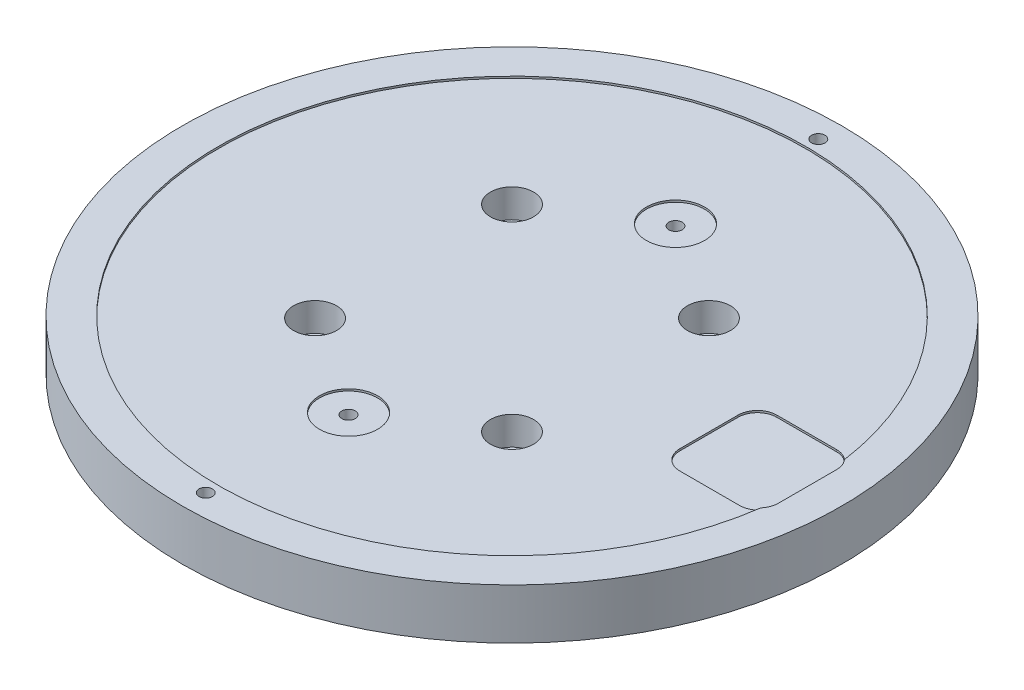
ISO-10303-21;
HEADER;
FILE_DESCRIPTION(('STEP AP214'),'2;1');
FILE_NAME('part.step','',(''),(''),'','','');
FILE_SCHEMA(('AUTOMOTIVE_DESIGN { 1 0 10303 214 1 1 1 1 }'));
ENDSEC;
DATA;
#1=APPLICATION_CONTEXT('core data for automotive mechanical design processes');
#2=APPLICATION_PROTOCOL_DEFINITION('international standard','automotive_design',2000,#1);
#3=PRODUCT_CONTEXT('',#1,'mechanical');
#4=PRODUCT('Part','Part','',(#3));
#5=PRODUCT_RELATED_PRODUCT_CATEGORY('part','',(#4));
#6=PRODUCT_DEFINITION_FORMATION('','',#4);
#7=PRODUCT_DEFINITION_CONTEXT('part definition',#1,'design');
#8=PRODUCT_DEFINITION('design','',#6,#7);
#9=PRODUCT_DEFINITION_SHAPE('','',#8);
#10=(LENGTH_UNIT() NAMED_UNIT(*) SI_UNIT(.MILLI.,.METRE.));
#11=(NAMED_UNIT(*) PLANE_ANGLE_UNIT() SI_UNIT($,.RADIAN.));
#12=(NAMED_UNIT(*) SI_UNIT($,.STERADIAN.) SOLID_ANGLE_UNIT());
#13=UNCERTAINTY_MEASURE_WITH_UNIT(LENGTH_MEASURE(1.E-05),#10,'distance_accuracy_value','');
#14=(GEOMETRIC_REPRESENTATION_CONTEXT(3) GLOBAL_UNCERTAINTY_ASSIGNED_CONTEXT((#13)) GLOBAL_UNIT_ASSIGNED_CONTEXT((#10,
#11,#12)) REPRESENTATION_CONTEXT('',''));
#15=CARTESIAN_POINT('',(0.,0.,0.));
#16=DIRECTION('',(0.,0.,1.));
#17=DIRECTION('',(1.,0.,0.));
#18=AXIS2_PLACEMENT_3D('',#15,#16,#17);
#19=CARTESIAN_POINT('',(0.,-13.,0.));
#20=DIRECTION('',(0.,1.,0.));
#21=DIRECTION('',(0.,0.,1.));
#22=AXIS2_PLACEMENT_3D('',#19,#20,#21);
#23=CYLINDRICAL_SURFACE('',#22,85.);
#24=CARTESIAN_POINT('',(0.,-13.,0.));
#25=DIRECTION('',(0.,1.,0.));
#26=DIRECTION('',(0.,0.,1.));
#27=AXIS2_PLACEMENT_3D('',#24,#25,#26);
#28=CIRCLE('',#27,85.);
#29=CARTESIAN_POINT('',(0.,-13.,85.));
#30=VERTEX_POINT('',#29);
#31=EDGE_CURVE('E394',#30,#30,#28,.T.);
#32=CARTESIAN_POINT('',(0.,0.,0.));
#33=DIRECTION('',(0.,1.,0.));
#34=DIRECTION('',(0.,0.,1.));
#35=AXIS2_PLACEMENT_3D('',#32,#33,#34);
#36=CIRCLE('',#35,85.);
#37=CARTESIAN_POINT('',(0.,0.,85.));
#38=VERTEX_POINT('',#37);
#39=EDGE_CURVE('E398',#38,#38,#36,.T.);
#40=CARTESIAN_POINT('',(0.,-13.,85.));
#41=CARTESIAN_POINT('',(0.,-12.8645833333333,85.));
#42=CARTESIAN_POINT('',(0.,-12.7291666666667,85.));
#43=CARTESIAN_POINT('',(0.,-12.4583333333333,85.));
#44=CARTESIAN_POINT('',(0.,-12.3229166666667,85.));
#45=CARTESIAN_POINT('',(0.,-12.0520833333333,85.));
#46=CARTESIAN_POINT('',(0.,-11.9166666666667,85.));
#47=CARTESIAN_POINT('',(0.,-11.6458333333333,85.));
#48=CARTESIAN_POINT('',(0.,-11.5104166666667,85.));
#49=CARTESIAN_POINT('',(0.,-11.2395833333333,85.));
#50=CARTESIAN_POINT('',(0.,-11.1041666666667,85.));
#51=CARTESIAN_POINT('',(0.,-10.8333333333333,85.));
#52=CARTESIAN_POINT('',(0.,-10.6979166666667,85.));
#53=CARTESIAN_POINT('',(0.,-10.4270833333333,85.));
#54=CARTESIAN_POINT('',(0.,-10.2916666666667,85.));
#55=CARTESIAN_POINT('',(0.,-10.0208333333333,85.));
#56=CARTESIAN_POINT('',(0.,-9.88541666666667,85.));
#57=CARTESIAN_POINT('',(0.,-9.61458333333333,85.));
#58=CARTESIAN_POINT('',(0.,-9.47916666666667,85.));
#59=CARTESIAN_POINT('',(0.,-9.20833333333333,85.));
#60=CARTESIAN_POINT('',(0.,-9.07291666666667,85.));
#61=CARTESIAN_POINT('',(0.,-8.80208333333333,85.));
#62=CARTESIAN_POINT('',(0.,-8.66666666666667,85.));
#63=CARTESIAN_POINT('',(0.,-8.39583333333333,85.));
#64=CARTESIAN_POINT('',(0.,-8.26041666666667,85.));
#65=CARTESIAN_POINT('',(0.,-7.98958333333333,85.));
#66=CARTESIAN_POINT('',(0.,-7.85416666666667,85.));
#67=CARTESIAN_POINT('',(0.,-7.58333333333333,85.));
#68=CARTESIAN_POINT('',(0.,-7.44791666666667,85.));
#69=CARTESIAN_POINT('',(0.,-7.17708333333333,85.));
#70=CARTESIAN_POINT('',(0.,-7.04166666666667,85.));
#71=CARTESIAN_POINT('',(0.,-6.77083333333333,85.));
#72=CARTESIAN_POINT('',(0.,-6.63541666666667,85.));
#73=CARTESIAN_POINT('',(0.,-6.36458333333333,85.));
#74=CARTESIAN_POINT('',(0.,-6.22916666666667,85.));
#75=CARTESIAN_POINT('',(0.,-5.95833333333333,85.));
#76=CARTESIAN_POINT('',(0.,-5.82291666666667,85.));
#77=CARTESIAN_POINT('',(0.,-5.55208333333333,85.));
#78=CARTESIAN_POINT('',(0.,-5.41666666666667,85.));
#79=CARTESIAN_POINT('',(0.,-5.14583333333333,85.));
#80=CARTESIAN_POINT('',(0.,-5.01041666666667,85.));
#81=CARTESIAN_POINT('',(0.,-4.73958333333333,85.));
#82=CARTESIAN_POINT('',(0.,-4.60416666666667,85.));
#83=CARTESIAN_POINT('',(0.,-4.33333333333333,85.));
#84=CARTESIAN_POINT('',(0.,-4.19791666666667,85.));
#85=CARTESIAN_POINT('',(0.,-3.92708333333333,85.));
#86=CARTESIAN_POINT('',(0.,-3.79166666666667,85.));
#87=CARTESIAN_POINT('',(0.,-3.52083333333333,85.));
#88=CARTESIAN_POINT('',(0.,-3.38541666666667,85.));
#89=CARTESIAN_POINT('',(0.,-3.11458333333333,85.));
#90=CARTESIAN_POINT('',(0.,-2.97916666666667,85.));
#91=CARTESIAN_POINT('',(0.,-2.70833333333333,85.));
#92=CARTESIAN_POINT('',(0.,-2.57291666666667,85.));
#93=CARTESIAN_POINT('',(0.,-2.30208333333333,85.));
#94=CARTESIAN_POINT('',(0.,-2.16666666666667,85.));
#95=CARTESIAN_POINT('',(0.,-1.89583333333333,85.));
#96=CARTESIAN_POINT('',(0.,-1.76041666666667,85.));
#97=CARTESIAN_POINT('',(0.,-1.48958333333333,85.));
#98=CARTESIAN_POINT('',(0.,-1.35416666666667,85.));
#99=CARTESIAN_POINT('',(0.,-1.08333333333333,85.));
#100=CARTESIAN_POINT('',(0.,-0.947916666666667,85.));
#101=CARTESIAN_POINT('',(0.,-0.677083333333334,85.));
#102=CARTESIAN_POINT('',(0.,-0.541666666666667,85.));
#103=CARTESIAN_POINT('',(0.,-0.270833333333334,85.));
#104=CARTESIAN_POINT('',(0.,-0.135416666666667,85.));
#105=CARTESIAN_POINT('',(0.,0.,85.));
#106=B_SPLINE_CURVE_WITH_KNOTS('',3,(#40,#41,#42,#43,#44,#45,#46,#47,#48,#49,#50,#51,#52,#53,
#54,#55,#56,#57,#58,#59,#60,#61,#62,#63,#64,#65,#66,#67,#68,#69,#70,#71,#72,#73,#74,#75,#76,#77,
#78,#79,#80,#81,#82,#83,#84,#85,#86,#87,#88,#89,#90,#91,#92,#93,#94,#95,#96,#97,#98,#99,#100,
#101,#102,#103,#104,#105),.UNSPECIFIED.,.F.,.F.,(4,2,2,2,2,2,2,2,2,2,2,2,2,2,2,2,2,2,2,2,2,2,2,
2,2,2,2,2,2,2,2,2,4),(0.,0.40625,0.812500000000001,1.21875,1.625,2.03125,2.4375,2.84375,3.25,
3.65625,4.0625,4.46875,4.875,5.28125,5.6875,6.09375,6.5,6.90625,7.3125,7.71875,8.125,8.53125,
8.9375,9.34375,9.75,10.15625,10.5625,10.96875,11.375,11.78125,12.1875,12.59375,13.),.UNSPECIFIED.);
#107=EDGE_CURVE('BSEAM41',#30,#38,#106,.T.);
#108=ORIENTED_EDGE('',*,*,#31,.T.);
#109=ORIENTED_EDGE('',*,*,#39,.F.);
#110=ORIENTED_EDGE('',*,*,#107,.T.);
#111=ORIENTED_EDGE('',*,*,#107,.F.);
#112=EDGE_LOOP('',(#108,#110,#109,#111));
#113=FACE_BOUND('',#112,.T.);
#114=ADVANCED_FACE('F41',(#113),#23,.T.);
#115=CARTESIAN_POINT('',(0.,-13.,0.));
#116=DIRECTION('',(0.,1.,0.));
#117=DIRECTION('',(0.,0.,1.));
#118=AXIS2_PLACEMENT_3D('',#115,#116,#117);
#119=PLANE('',#118);
#120=CARTESIAN_POINT('',(-25.4,-13.,25.4));
#121=DIRECTION('',(0.,1.,0.));
#122=DIRECTION('',(0.,0.,1.));
#123=AXIS2_PLACEMENT_3D('',#120,#121,#122);
#124=CIRCLE('',#123,3.3782);
#125=CARTESIAN_POINT('',(-25.4,-13.,28.7782));
#126=VERTEX_POINT('',#125);
#127=EDGE_CURVE('E420',#126,#126,#124,.T.);
#128=ORIENTED_EDGE('',*,*,#127,.T.);
#129=EDGE_LOOP('',(#128));
#130=FACE_BOUND('',#129,.T.);
#131=CARTESIAN_POINT('',(25.4,-13.,25.4));
#132=DIRECTION('',(0.,1.,0.));
#133=DIRECTION('',(0.,0.,1.));
#134=AXIS2_PLACEMENT_3D('',#131,#132,#133);
#135=CIRCLE('',#134,3.3782);
#136=CARTESIAN_POINT('',(25.4,-13.,28.7782));
#137=VERTEX_POINT('',#136);
#138=EDGE_CURVE('E426',#137,#137,#135,.T.);
#139=ORIENTED_EDGE('',*,*,#138,.T.);
#140=EDGE_LOOP('',(#139));
#141=FACE_BOUND('',#140,.T.);
#142=CARTESIAN_POINT('',(25.4,-13.,-25.4));
#143=DIRECTION('',(0.,1.,0.));
#144=DIRECTION('',(0.,0.,1.));
#145=AXIS2_PLACEMENT_3D('',#142,#143,#144);
#146=CIRCLE('',#145,3.3782);
#147=CARTESIAN_POINT('',(25.4,-13.,-22.0218));
#148=VERTEX_POINT('',#147);
#149=EDGE_CURVE('E433',#148,#148,#146,.T.);
#150=ORIENTED_EDGE('',*,*,#149,.T.);
#151=EDGE_LOOP('',(#150));
#152=FACE_BOUND('',#151,.T.);
#153=CARTESIAN_POINT('',(-25.4,-13.,-25.4));
#154=DIRECTION('',(0.,1.,0.));
#155=DIRECTION('',(0.,0.,1.));
#156=AXIS2_PLACEMENT_3D('',#153,#154,#155);
#157=CIRCLE('',#156,3.3782);
#158=CARTESIAN_POINT('',(-25.4,-13.,-22.0218));
#159=VERTEX_POINT('',#158);
#160=EDGE_CURVE('E439',#159,#159,#157,.T.);
#161=ORIENTED_EDGE('',*,*,#160,.T.);
#162=EDGE_LOOP('',(#161));
#163=FACE_BOUND('',#162,.T.);
#164=ORIENTED_EDGE('',*,*,#31,.F.);
#165=EDGE_LOOP('',(#164));
#166=FACE_BOUND('',#165,.T.);
#167=ADVANCED_FACE('F965',(#130,#141,#152,#163,#166),#119,.F.);
#168=CARTESIAN_POINT('',(0.,0.,0.));
#169=DIRECTION('',(0.,1.,0.));
#170=DIRECTION('',(0.,0.,1.));
#171=AXIS2_PLACEMENT_3D('',#168,#169,#170);
#172=PLANE('',#171);
#173=CARTESIAN_POINT('',(0.,0.,0.));
#174=DIRECTION('',(0.,1.,0.));
#175=DIRECTION('',(0.,0.,1.));
#176=AXIS2_PLACEMENT_3D('',#173,#174,#175);
#177=CIRCLE('',#176,75.75);
#178=CARTESIAN_POINT('',(74.9800609938417,0.,-10.7727876317959));
#179=VERTEX_POINT('',#178);
#180=CARTESIAN_POINT('',(74.9800609938417,0.,10.7727876317959));
#181=VERTEX_POINT('',#180);
#182=EDGE_CURVE('E73',#179,#181,#177,.T.);
#183=ORIENTED_EDGE('',*,*,#182,.F.);
#184=CARTESIAN_POINT('',(71.2,0.,-7.50000000000001));
#185=DIRECTION('',(0.,1.,0.));
#186=DIRECTION('',(0.,0.,1.));
#187=AXIS2_PLACEMENT_3D('',#184,#185,#186);
#188=CIRCLE('',#187,5.);
#189=CARTESIAN_POINT('',(76.2,0.,-7.50000000000001));
#190=VERTEX_POINT('',#189);
#191=EDGE_CURVE('E447',#179,#190,#188,.F.);
#192=ORIENTED_EDGE('',*,*,#191,.T.);
#193=DIRECTION('',(0.,0.,-1.));
#194=VECTOR('',#193,1.);
#195=CARTESIAN_POINT('',(76.2,0.,12.5));
#196=LINE('',#195,#194);
#197=CARTESIAN_POINT('',(76.2,0.,7.5));
#198=VERTEX_POINT('',#197);
#199=EDGE_CURVE('E195',#198,#190,#196,.T.);
#200=ORIENTED_EDGE('',*,*,#199,.F.);
#201=CARTESIAN_POINT('',(71.2,0.,7.5));
#202=DIRECTION('',(0.,1.,0.));
#203=DIRECTION('',(0.,0.,1.));
#204=AXIS2_PLACEMENT_3D('',#201,#202,#203);
#205=CIRCLE('',#204,5.);
#206=EDGE_CURVE('E351',#198,#181,#205,.F.);
#207=ORIENTED_EDGE('',*,*,#206,.T.);
#208=EDGE_LOOP('',(#183,#192,#200,#207));
#209=FACE_BOUND('',#208,.T.);
#210=CARTESIAN_POINT('',(0.,0.,-79.));
#211=DIRECTION('',(0.,1.,0.));
#212=DIRECTION('',(0.,0.,1.));
#213=AXIS2_PLACEMENT_3D('',#210,#211,#212);
#214=CIRCLE('',#213,1.7272);
#215=CARTESIAN_POINT('',(0.,0.,-77.2728));
#216=VERTEX_POINT('',#215);
#217=EDGE_CURVE('E456',#216,#216,#214,.T.);
#218=ORIENTED_EDGE('',*,*,#217,.F.);
#219=EDGE_LOOP('',(#218));
#220=FACE_BOUND('',#219,.T.);
#221=CARTESIAN_POINT('',(0.,0.,79.));
#222=DIRECTION('',(0.,1.,0.));
#223=DIRECTION('',(0.,0.,1.));
#224=AXIS2_PLACEMENT_3D('',#221,#222,#223);
#225=CIRCLE('',#224,1.7272);
#226=CARTESIAN_POINT('',(0.,0.,80.7272));
#227=VERTEX_POINT('',#226);
#228=EDGE_CURVE('E467',#227,#227,#225,.T.);
#229=ORIENTED_EDGE('',*,*,#228,.F.);
#230=EDGE_LOOP('',(#229));
#231=FACE_BOUND('',#230,.T.);
#232=ORIENTED_EDGE('',*,*,#39,.T.);
#233=EDGE_LOOP('',(#232));
#234=FACE_BOUND('',#233,.T.);
#235=ADVANCED_FACE('F482',(#209,#220,#231,#234),#172,.T.);
#236=CARTESIAN_POINT('',(0.,-0.5,0.));
#237=DIRECTION('',(0.,1.,0.));
#238=DIRECTION('',(0.,0.,1.));
#239=AXIS2_PLACEMENT_3D('',#236,#237,#238);
#240=CYLINDRICAL_SURFACE('',#239,75.75);
#241=CARTESIAN_POINT('',(0.,-0.5,0.));
#242=DIRECTION('',(0.,1.,0.));
#243=DIRECTION('',(0.,0.,1.));
#244=AXIS2_PLACEMENT_3D('',#241,#242,#243);
#245=CIRCLE('',#244,75.75);
#246=CARTESIAN_POINT('',(74.9800609938417,-0.5,-10.7727876317959));
#247=VERTEX_POINT('',#246);
#248=CARTESIAN_POINT('',(74.9800609938417,-0.5,10.7727876317959));
#249=VERTEX_POINT('',#248);
#250=EDGE_CURVE('E62',#247,#249,#245,.T.);
#251=ORIENTED_EDGE('',*,*,#250,.F.);
#252=DIRECTION('',(0.,-1.,0.));
#253=VECTOR('',#252,1.);
#254=CARTESIAN_POINT('',(74.9800609938417,-0.5,-10.7727876317959));
#255=LINE('',#254,#253);
#256=EDGE_CURVE('E250',#247,#179,#255,.F.);
#257=ORIENTED_EDGE('',*,*,#256,.T.);
#258=ORIENTED_EDGE('',*,*,#182,.T.);
#259=DIRECTION('',(0.,-1.,0.));
#260=VECTOR('',#259,1.);
#261=CARTESIAN_POINT('',(74.9800609938417,0.,10.7727876317959));
#262=LINE('',#261,#260);
#263=EDGE_CURVE('E261',#181,#249,#262,.T.);
#264=ORIENTED_EDGE('',*,*,#263,.T.);
#265=EDGE_LOOP('',(#251,#257,#258,#264));
#266=FACE_BOUND('',#265,.T.);
#267=ADVANCED_FACE('F505',(#266),#240,.F.);
#268=CARTESIAN_POINT('',(0.,-0.5,0.));
#269=DIRECTION('',(0.,1.,0.));
#270=DIRECTION('',(0.,0.,1.));
#271=AXIS2_PLACEMENT_3D('',#268,#269,#270);
#272=PLANE('',#271);
#273=CARTESIAN_POINT('',(0.,-0.5,42.164));
#274=DIRECTION('',(0.,1.,0.));
#275=DIRECTION('',(0.,0.,1.));
#276=AXIS2_PLACEMENT_3D('',#273,#274,#275);
#277=CIRCLE('',#276,7.5);
#278=CARTESIAN_POINT('',(0.,-0.5,49.664));
#279=VERTEX_POINT('',#278);
#280=EDGE_CURVE('E196',#279,#279,#277,.T.);
#281=ORIENTED_EDGE('',*,*,#280,.F.);
#282=EDGE_LOOP('',(#281));
#283=FACE_BOUND('',#282,.T.);
#284=CARTESIAN_POINT('',(0.,-0.5,-42.164));
#285=DIRECTION('',(0.,1.,0.));
#286=DIRECTION('',(0.,0.,1.));
#287=AXIS2_PLACEMENT_3D('',#284,#285,#286);
#288=CIRCLE('',#287,7.5);
#289=CARTESIAN_POINT('',(0.,-0.5,-34.664));
#290=VERTEX_POINT('',#289);
#291=EDGE_CURVE('E212',#290,#290,#288,.T.);
#292=ORIENTED_EDGE('',*,*,#291,.F.);
#293=EDGE_LOOP('',(#292));
#294=FACE_BOUND('',#293,.T.);
#295=DIRECTION('',(-1.,0.,0.));
#296=VECTOR('',#295,1.);
#297=CARTESIAN_POINT('',(0.,-0.5,-12.5));
#298=LINE('',#297,#296);
#299=CARTESIAN_POINT('',(71.2,-0.5,-12.5));
#300=VERTEX_POINT('',#299);
#301=CARTESIAN_POINT('',(55.8,-0.5,-12.5));
#302=VERTEX_POINT('',#301);
#303=EDGE_CURVE('E274',#300,#302,#298,.T.);
#304=ORIENTED_EDGE('',*,*,#303,.F.);
#305=CARTESIAN_POINT('',(71.2,-0.5,-7.50000000000001));
#306=DIRECTION('',(0.,1.,0.));
#307=DIRECTION('',(0.,0.,1.));
#308=AXIS2_PLACEMENT_3D('',#305,#306,#307);
#309=CIRCLE('',#308,5.);
#310=EDGE_CURVE('E246',#300,#247,#309,.F.);
#311=ORIENTED_EDGE('',*,*,#310,.T.);
#312=ORIENTED_EDGE('',*,*,#250,.T.);
#313=CARTESIAN_POINT('',(71.2,-0.5,7.5));
#314=DIRECTION('',(0.,1.,0.));
#315=DIRECTION('',(0.,0.,1.));
#316=AXIS2_PLACEMENT_3D('',#313,#314,#315);
#317=CIRCLE('',#316,5.);
#318=CARTESIAN_POINT('',(71.2,-0.5,12.5));
#319=VERTEX_POINT('',#318);
#320=EDGE_CURVE('E258',#249,#319,#317,.F.);
#321=ORIENTED_EDGE('',*,*,#320,.T.);
#322=DIRECTION('',(1.,0.,0.));
#323=VECTOR('',#322,1.);
#324=CARTESIAN_POINT('',(0.,-0.5,12.5));
#325=LINE('',#324,#323);
#326=CARTESIAN_POINT('',(55.8,-0.5,12.5));
#327=VERTEX_POINT('',#326);
#328=EDGE_CURVE('E275',#327,#319,#325,.T.);
#329=ORIENTED_EDGE('',*,*,#328,.F.);
#330=CARTESIAN_POINT('',(55.8,-0.5,7.5));
#331=DIRECTION('',(0.,1.,0.));
#332=DIRECTION('',(0.,0.,1.));
#333=AXIS2_PLACEMENT_3D('',#330,#331,#332);
#334=CIRCLE('',#333,5.);
#335=CARTESIAN_POINT('',(50.8,-0.5,7.5));
#336=VERTEX_POINT('',#335);
#337=EDGE_CURVE('E51',#327,#336,#334,.F.);
#338=ORIENTED_EDGE('',*,*,#337,.T.);
#339=DIRECTION('',(0.,0.,1.));
#340=VECTOR('',#339,1.);
#341=CARTESIAN_POINT('',(50.8,-0.5,0.));
#342=LINE('',#341,#340);
#343=CARTESIAN_POINT('',(50.8,-0.5,-7.50000000000001));
#344=VERTEX_POINT('',#343);
#345=EDGE_CURVE('E270',#344,#336,#342,.T.);
#346=ORIENTED_EDGE('',*,*,#345,.F.);
#347=CARTESIAN_POINT('',(55.8,-0.5,-7.50000000000001));
#348=DIRECTION('',(0.,1.,0.));
#349=DIRECTION('',(0.,0.,1.));
#350=AXIS2_PLACEMENT_3D('',#347,#348,#349);
#351=CIRCLE('',#350,5.);
#352=EDGE_CURVE('E12',#344,#302,#351,.F.);
#353=ORIENTED_EDGE('',*,*,#352,.T.);
#354=EDGE_LOOP('',(#304,#311,#312,#321,#329,#338,#346,#353));
#355=FACE_BOUND('',#354,.T.);
#356=CARTESIAN_POINT('',(-25.4,-0.5,25.4));
#357=DIRECTION('',(0.,1.,0.));
#358=DIRECTION('',(0.,0.,1.));
#359=AXIS2_PLACEMENT_3D('',#356,#357,#358);
#360=CIRCLE('',#359,5.55625);
#361=CARTESIAN_POINT('',(-25.4,-0.5,30.95625));
#362=VERTEX_POINT('',#361);
#363=EDGE_CURVE('E728',#362,#362,#360,.T.);
#364=ORIENTED_EDGE('',*,*,#363,.F.);
#365=EDGE_LOOP('',(#364));
#366=FACE_BOUND('',#365,.T.);
#367=CARTESIAN_POINT('',(25.4,-0.5,25.4));
#368=DIRECTION('',(0.,1.,0.));
#369=DIRECTION('',(0.,0.,1.));
#370=AXIS2_PLACEMENT_3D('',#367,#368,#369);
#371=CIRCLE('',#370,5.55625);
#372=CARTESIAN_POINT('',(25.4,-0.5,30.95625));
#373=VERTEX_POINT('',#372);
#374=EDGE_CURVE('E424',#373,#373,#371,.T.);
#375=ORIENTED_EDGE('',*,*,#374,.F.);
#376=EDGE_LOOP('',(#375));
#377=FACE_BOUND('',#376,.T.);
#378=CARTESIAN_POINT('',(25.4,-0.5,-25.4));
#379=DIRECTION('',(0.,1.,0.));
#380=DIRECTION('',(0.,0.,1.));
#381=AXIS2_PLACEMENT_3D('',#378,#379,#380);
#382=CIRCLE('',#381,5.55625);
#383=CARTESIAN_POINT('',(25.4,-0.5,-19.84375));
#384=VERTEX_POINT('',#383);
#385=EDGE_CURVE('E431',#384,#384,#382,.T.);
#386=ORIENTED_EDGE('',*,*,#385,.F.);
#387=EDGE_LOOP('',(#386));
#388=FACE_BOUND('',#387,.T.);
#389=CARTESIAN_POINT('',(-25.4,-0.5,-25.4));
#390=DIRECTION('',(0.,1.,0.));
#391=DIRECTION('',(0.,0.,1.));
#392=AXIS2_PLACEMENT_3D('',#389,#390,#391);
#393=CIRCLE('',#392,5.55625);
#394=CARTESIAN_POINT('',(-25.4,-0.5,-19.84375));
#395=VERTEX_POINT('',#394);
#396=EDGE_CURVE('E437',#395,#395,#393,.T.);
#397=ORIENTED_EDGE('',*,*,#396,.F.);
#398=EDGE_LOOP('',(#397));
#399=FACE_BOUND('',#398,.T.);
#400=ADVANCED_FACE('F370',(#283,#294,#355,#366,#377,#388,#399),#272,.T.);
#401=CARTESIAN_POINT('',(-25.4,-0.5,-25.4));
#402=DIRECTION('',(0.,1.,0.));
#403=DIRECTION('',(0.,0.,1.));
#404=AXIS2_PLACEMENT_3D('',#401,#402,#403);
#405=CYLINDRICAL_SURFACE('',#404,3.3782);
#406=CARTESIAN_POINT('',(-25.4,-7.849998,-25.4));
#407=DIRECTION('',(0.,1.,0.));
#408=DIRECTION('',(0.,0.,1.));
#409=AXIS2_PLACEMENT_3D('',#406,#407,#408);
#410=CIRCLE('',#409,3.3782);
#411=CARTESIAN_POINT('',(-25.4,-7.849998,-22.0218));
#412=VERTEX_POINT('',#411);
#413=EDGE_CURVE('E525',#412,#412,#410,.T.);
#414=ORIENTED_EDGE('',*,*,#413,.T.);
#415=EDGE_LOOP('',(#414));
#416=FACE_BOUND('',#415,.T.);
#417=ORIENTED_EDGE('',*,*,#160,.F.);
#418=EDGE_LOOP('',(#417));
#419=FACE_BOUND('',#418,.T.);
#420=ADVANCED_FACE('F954',(#416,#419),#405,.F.);
#421=CARTESIAN_POINT('',(-22.0218,-7.849998,-25.4));
#422=DIRECTION('',(0.,-1.,0.));
#423=DIRECTION('',(0.,0.,-1.));
#424=AXIS2_PLACEMENT_3D('',#421,#422,#423);
#425=PLANE('',#424);
#426=ORIENTED_EDGE('',*,*,#413,.F.);
#427=EDGE_LOOP('',(#426));
#428=FACE_BOUND('',#427,.T.);
#429=CARTESIAN_POINT('',(-25.4,-7.849998,-25.4));
#430=DIRECTION('',(0.,1.,0.));
#431=DIRECTION('',(0.,0.,1.));
#432=AXIS2_PLACEMENT_3D('',#429,#430,#431);
#433=CIRCLE('',#432,5.55625);
#434=CARTESIAN_POINT('',(-25.4,-7.849998,-19.84375));
#435=VERTEX_POINT('',#434);
#436=EDGE_CURVE('E530',#435,#435,#433,.T.);
#437=ORIENTED_EDGE('',*,*,#436,.T.);
#438=EDGE_LOOP('',(#437));
#439=FACE_BOUND('',#438,.T.);
#440=ADVANCED_FACE('F563',(#428,#439),#425,.F.);
#441=CARTESIAN_POINT('',(-25.4,-0.5,-25.4));
#442=DIRECTION('',(0.,1.,0.));
#443=DIRECTION('',(0.,0.,1.));
#444=AXIS2_PLACEMENT_3D('',#441,#442,#443);
#445=CYLINDRICAL_SURFACE('',#444,5.55625);
#446=ORIENTED_EDGE('',*,*,#436,.F.);
#447=EDGE_LOOP('',(#446));
#448=FACE_BOUND('',#447,.T.);
#449=ORIENTED_EDGE('',*,*,#396,.T.);
#450=EDGE_LOOP('',(#449));
#451=FACE_BOUND('',#450,.T.);
#452=ADVANCED_FACE('F566',(#448,#451),#445,.F.);
#453=CARTESIAN_POINT('',(25.4,-0.5,-25.4));
#454=DIRECTION('',(0.,1.,0.));
#455=DIRECTION('',(0.,0.,1.));
#456=AXIS2_PLACEMENT_3D('',#453,#454,#455);
#457=CYLINDRICAL_SURFACE('',#456,3.3782);
#458=CARTESIAN_POINT('',(25.4,-7.849998,-25.4));
#459=DIRECTION('',(0.,1.,0.));
#460=DIRECTION('',(0.,0.,1.));
#461=AXIS2_PLACEMENT_3D('',#458,#459,#460);
#462=CIRCLE('',#461,3.3782);
#463=CARTESIAN_POINT('',(25.4,-7.849998,-22.0218));
#464=VERTEX_POINT('',#463);
#465=EDGE_CURVE('E438',#464,#464,#462,.T.);
#466=ORIENTED_EDGE('',*,*,#465,.T.);
#467=EDGE_LOOP('',(#466));
#468=FACE_BOUND('',#467,.T.);
#469=ORIENTED_EDGE('',*,*,#149,.F.);
#470=EDGE_LOOP('',(#469));
#471=FACE_BOUND('',#470,.T.);
#472=ADVANCED_FACE('F570',(#468,#471),#457,.F.);
#473=CARTESIAN_POINT('',(28.7782,-7.849998,-25.4));
#474=DIRECTION('',(0.,-1.,0.));
#475=DIRECTION('',(0.,0.,-1.));
#476=AXIS2_PLACEMENT_3D('',#473,#474,#475);
#477=PLANE('',#476);
#478=ORIENTED_EDGE('',*,*,#465,.F.);
#479=EDGE_LOOP('',(#478));
#480=FACE_BOUND('',#479,.T.);
#481=CARTESIAN_POINT('',(25.4,-7.849998,-25.4));
#482=DIRECTION('',(0.,1.,0.));
#483=DIRECTION('',(0.,0.,1.));
#484=AXIS2_PLACEMENT_3D('',#481,#482,#483);
#485=CIRCLE('',#484,5.55625);
#486=CARTESIAN_POINT('',(25.4,-7.849998,-19.84375));
#487=VERTEX_POINT('',#486);
#488=EDGE_CURVE('E545',#487,#487,#485,.T.);
#489=ORIENTED_EDGE('',*,*,#488,.T.);
#490=EDGE_LOOP('',(#489));
#491=FACE_BOUND('',#490,.T.);
#492=ADVANCED_FACE('F578',(#480,#491),#477,.F.);
#493=CARTESIAN_POINT('',(25.4,-0.5,-25.4));
#494=DIRECTION('',(0.,1.,0.));
#495=DIRECTION('',(0.,0.,1.));
#496=AXIS2_PLACEMENT_3D('',#493,#494,#495);
#497=CYLINDRICAL_SURFACE('',#496,5.55625);
#498=ORIENTED_EDGE('',*,*,#488,.F.);
#499=EDGE_LOOP('',(#498));
#500=FACE_BOUND('',#499,.T.);
#501=ORIENTED_EDGE('',*,*,#385,.T.);
#502=EDGE_LOOP('',(#501));
#503=FACE_BOUND('',#502,.T.);
#504=ADVANCED_FACE('F596',(#500,#503),#497,.F.);
#505=CARTESIAN_POINT('',(25.4,-0.5,25.4));
#506=DIRECTION('',(0.,1.,0.));
#507=DIRECTION('',(0.,0.,1.));
#508=AXIS2_PLACEMENT_3D('',#505,#506,#507);
#509=CYLINDRICAL_SURFACE('',#508,3.3782);
#510=CARTESIAN_POINT('',(25.4,-7.849998,25.4));
#511=DIRECTION('',(0.,1.,0.));
#512=DIRECTION('',(0.,0.,1.));
#513=AXIS2_PLACEMENT_3D('',#510,#511,#512);
#514=CIRCLE('',#513,3.3782);
#515=CARTESIAN_POINT('',(25.4,-7.849998,28.7782));
#516=VERTEX_POINT('',#515);
#517=EDGE_CURVE('E432',#516,#516,#514,.T.);
#518=ORIENTED_EDGE('',*,*,#517,.T.);
#519=EDGE_LOOP('',(#518));
#520=FACE_BOUND('',#519,.T.);
#521=ORIENTED_EDGE('',*,*,#138,.F.);
#522=EDGE_LOOP('',(#521));
#523=FACE_BOUND('',#522,.T.);
#524=ADVANCED_FACE('F615',(#520,#523),#509,.F.);
#525=CARTESIAN_POINT('',(28.7782,-7.849998,25.4));
#526=DIRECTION('',(0.,-1.,0.));
#527=DIRECTION('',(0.,0.,-1.));
#528=AXIS2_PLACEMENT_3D('',#525,#526,#527);
#529=PLANE('',#528);
#530=ORIENTED_EDGE('',*,*,#517,.F.);
#531=EDGE_LOOP('',(#530));
#532=FACE_BOUND('',#531,.T.);
#533=CARTESIAN_POINT('',(25.4,-7.849998,25.4));
#534=DIRECTION('',(0.,1.,0.));
#535=DIRECTION('',(0.,0.,1.));
#536=AXIS2_PLACEMENT_3D('',#533,#534,#535);
#537=CIRCLE('',#536,5.55625);
#538=CARTESIAN_POINT('',(25.4,-7.849998,30.95625));
#539=VERTEX_POINT('',#538);
#540=EDGE_CURVE('E646',#539,#539,#537,.T.);
#541=ORIENTED_EDGE('',*,*,#540,.T.);
#542=EDGE_LOOP('',(#541));
#543=FACE_BOUND('',#542,.T.);
#544=ADVANCED_FACE('F632',(#532,#543),#529,.F.);
#545=CARTESIAN_POINT('',(25.4,-0.5,25.4));
#546=DIRECTION('',(0.,1.,0.));
#547=DIRECTION('',(0.,0.,1.));
#548=AXIS2_PLACEMENT_3D('',#545,#546,#547);
#549=CYLINDRICAL_SURFACE('',#548,5.55625);
#550=ORIENTED_EDGE('',*,*,#540,.F.);
#551=EDGE_LOOP('',(#550));
#552=FACE_BOUND('',#551,.T.);
#553=ORIENTED_EDGE('',*,*,#374,.T.);
#554=EDGE_LOOP('',(#553));
#555=FACE_BOUND('',#554,.T.);
#556=ADVANCED_FACE('F653',(#552,#555),#549,.F.);
#557=CARTESIAN_POINT('',(-25.4,-0.5,25.4));
#558=DIRECTION('',(0.,1.,0.));
#559=DIRECTION('',(0.,0.,1.));
#560=AXIS2_PLACEMENT_3D('',#557,#558,#559);
#561=CYLINDRICAL_SURFACE('',#560,3.3782);
#562=CARTESIAN_POINT('',(-25.4,-7.849998,25.4));
#563=DIRECTION('',(0.,1.,0.));
#564=DIRECTION('',(0.,0.,1.));
#565=AXIS2_PLACEMENT_3D('',#562,#563,#564);
#566=CIRCLE('',#565,3.3782);
#567=CARTESIAN_POINT('',(-25.4,-7.849998,28.7782));
#568=VERTEX_POINT('',#567);
#569=EDGE_CURVE('E425',#568,#568,#566,.T.);
#570=ORIENTED_EDGE('',*,*,#569,.T.);
#571=EDGE_LOOP('',(#570));
#572=FACE_BOUND('',#571,.T.);
#573=ORIENTED_EDGE('',*,*,#127,.F.);
#574=EDGE_LOOP('',(#573));
#575=FACE_BOUND('',#574,.T.);
#576=ADVANCED_FACE('F673',(#572,#575),#561,.F.);
#577=CARTESIAN_POINT('',(-22.0218,-7.849998,25.4));
#578=DIRECTION('',(0.,-1.,0.));
#579=DIRECTION('',(0.,0.,-1.));
#580=AXIS2_PLACEMENT_3D('',#577,#578,#579);
#581=PLANE('',#580);
#582=ORIENTED_EDGE('',*,*,#569,.F.);
#583=EDGE_LOOP('',(#582));
#584=FACE_BOUND('',#583,.T.);
#585=CARTESIAN_POINT('',(-25.4,-7.849998,25.4));
#586=DIRECTION('',(0.,1.,0.));
#587=DIRECTION('',(0.,0.,1.));
#588=AXIS2_PLACEMENT_3D('',#585,#586,#587);
#589=CIRCLE('',#588,5.55625);
#590=CARTESIAN_POINT('',(-25.4,-7.849998,30.95625));
#591=VERTEX_POINT('',#590);
#592=EDGE_CURVE('E704',#591,#591,#589,.T.);
#593=ORIENTED_EDGE('',*,*,#592,.T.);
#594=EDGE_LOOP('',(#593));
#595=FACE_BOUND('',#594,.T.);
#596=ADVANCED_FACE('F690',(#584,#595),#581,.F.);
#597=CARTESIAN_POINT('',(-25.4,-0.5,25.4));
#598=DIRECTION('',(0.,1.,0.));
#599=DIRECTION('',(0.,0.,1.));
#600=AXIS2_PLACEMENT_3D('',#597,#598,#599);
#601=CYLINDRICAL_SURFACE('',#600,5.55625);
#602=ORIENTED_EDGE('',*,*,#592,.F.);
#603=EDGE_LOOP('',(#602));
#604=FACE_BOUND('',#603,.T.);
#605=ORIENTED_EDGE('',*,*,#363,.T.);
#606=EDGE_LOOP('',(#605));
#607=FACE_BOUND('',#606,.T.);
#608=ADVANCED_FACE('F711',(#604,#607),#601,.F.);
#609=CARTESIAN_POINT('',(0.,-8.,79.));
#610=DIRECTION('',(0.,1.,0.));
#611=DIRECTION('',(0.,0.,1.));
#612=AXIS2_PLACEMENT_3D('',#609,#610,#611);
#613=CONICAL_SURFACE('',#612,1.7272,1.02974425867665);
#614=CARTESIAN_POINT('',(0.,-9.0378064611844,79.));
#615=VERTEX_POINT('',#614);
#616=VERTEX_LOOP('',#615);
#617=FACE_BOUND('',#616,.T.);
#618=CARTESIAN_POINT('',(0.,-8.,79.));
#619=DIRECTION('',(0.,1.,0.));
#620=DIRECTION('',(0.,0.,1.));
#621=AXIS2_PLACEMENT_3D('',#618,#619,#620);
#622=CIRCLE('',#621,1.7272);
#623=CARTESIAN_POINT('',(0.,-8.,80.7272));
#624=VERTEX_POINT('',#623);
#625=EDGE_CURVE('E502',#624,#624,#622,.T.);
#626=ORIENTED_EDGE('',*,*,#625,.T.);
#627=EDGE_LOOP('',(#626));
#628=FACE_BOUND('',#627,.T.);
#629=ADVANCED_FACE('F732',(#617,#628),#613,.F.);
#630=CARTESIAN_POINT('',(0.,0.,79.));
#631=DIRECTION('',(0.,1.,0.));
#632=DIRECTION('',(0.,0.,1.));
#633=AXIS2_PLACEMENT_3D('',#630,#631,#632);
#634=CYLINDRICAL_SURFACE('',#633,1.7272);
#635=ORIENTED_EDGE('',*,*,#625,.F.);
#636=EDGE_LOOP('',(#635));
#637=FACE_BOUND('',#636,.T.);
#638=ORIENTED_EDGE('',*,*,#228,.T.);
#639=EDGE_LOOP('',(#638));
#640=FACE_BOUND('',#639,.T.);
#641=ADVANCED_FACE('F749',(#637,#640),#634,.F.);
#642=CARTESIAN_POINT('',(0.,-8.,-79.));
#643=DIRECTION('',(0.,1.,0.));
#644=DIRECTION('',(0.,0.,1.));
#645=AXIS2_PLACEMENT_3D('',#642,#643,#644);
#646=CONICAL_SURFACE('',#645,1.7272,1.02974425867665);
#647=CARTESIAN_POINT('',(0.,-9.0378064611844,-79.));
#648=VERTEX_POINT('',#647);
#649=VERTEX_LOOP('',#648);
#650=FACE_BOUND('',#649,.T.);
#651=CARTESIAN_POINT('',(0.,-8.,-79.));
#652=DIRECTION('',(0.,1.,0.));
#653=DIRECTION('',(0.,0.,1.));
#654=AXIS2_PLACEMENT_3D('',#651,#652,#653);
#655=CIRCLE('',#654,1.7272);
#656=CARTESIAN_POINT('',(0.,-8.,-77.2728));
#657=VERTEX_POINT('',#656);
#658=EDGE_CURVE('E461',#657,#657,#655,.T.);
#659=ORIENTED_EDGE('',*,*,#658,.T.);
#660=EDGE_LOOP('',(#659));
#661=FACE_BOUND('',#660,.T.);
#662=ADVANCED_FACE('F769',(#650,#661),#646,.F.);
#663=CARTESIAN_POINT('',(0.,0.,-79.));
#664=DIRECTION('',(0.,1.,0.));
#665=DIRECTION('',(0.,0.,1.));
#666=AXIS2_PLACEMENT_3D('',#663,#664,#665);
#667=CYLINDRICAL_SURFACE('',#666,1.7272);
#668=ORIENTED_EDGE('',*,*,#658,.F.);
#669=EDGE_LOOP('',(#668));
#670=FACE_BOUND('',#669,.T.);
#671=ORIENTED_EDGE('',*,*,#217,.T.);
#672=EDGE_LOOP('',(#671));
#673=FACE_BOUND('',#672,.T.);
#674=ADVANCED_FACE('F787',(#670,#673),#667,.F.);
#675=CARTESIAN_POINT('',(76.2,-1.,-12.5));
#676=DIRECTION('',(0.,0.,-1.));
#677=DIRECTION('',(-1.,0.,0.));
#678=AXIS2_PLACEMENT_3D('',#675,#676,#677);
#679=PLANE('',#678);
#680=DIRECTION('',(-1.,0.,0.));
#681=VECTOR('',#680,1.);
#682=CARTESIAN_POINT('',(76.2,-1.,-12.5));
#683=LINE('',#682,#681);
#684=CARTESIAN_POINT('',(71.2,-1.,-12.5));
#685=VERTEX_POINT('',#684);
#686=CARTESIAN_POINT('',(55.8,-1.,-12.5));
#687=VERTEX_POINT('',#686);
#688=EDGE_CURVE('E347',#685,#687,#683,.T.);
#689=ORIENTED_EDGE('',*,*,#688,.F.);
#690=DIRECTION('',(0.,1.,0.));
#691=VECTOR('',#690,1.);
#692=CARTESIAN_POINT('',(71.2,0.,-12.5));
#693=LINE('',#692,#691);
#694=EDGE_CURVE('E286',#685,#300,#693,.T.);
#695=ORIENTED_EDGE('',*,*,#694,.T.);
#696=ORIENTED_EDGE('',*,*,#303,.T.);
#697=DIRECTION('',(0.,1.,0.));
#698=VECTOR('',#697,1.);
#699=CARTESIAN_POINT('',(55.8,-1.,-12.5));
#700=LINE('',#699,#698);
#701=EDGE_CURVE('E282',#302,#687,#700,.F.);
#702=ORIENTED_EDGE('',*,*,#701,.T.);
#703=EDGE_LOOP('',(#689,#695,#696,#702));
#704=FACE_BOUND('',#703,.T.);
#705=ADVANCED_FACE('F365',(#704),#679,.F.);
#706=CARTESIAN_POINT('',(76.2,-1.,12.5));
#707=DIRECTION('',(0.,0.,1.));
#708=DIRECTION('',(1.,0.,0.));
#709=AXIS2_PLACEMENT_3D('',#706,#707,#708);
#710=PLANE('',#709);
#711=ORIENTED_EDGE('',*,*,#328,.T.);
#712=DIRECTION('',(0.,1.,0.));
#713=VECTOR('',#712,1.);
#714=CARTESIAN_POINT('',(71.2,-1.,12.5));
#715=LINE('',#714,#713);
#716=CARTESIAN_POINT('',(71.2,-1.,12.5));
#717=VERTEX_POINT('',#716);
#718=EDGE_CURVE('E240',#319,#717,#715,.F.);
#719=ORIENTED_EDGE('',*,*,#718,.T.);
#720=DIRECTION('',(1.,0.,0.));
#721=VECTOR('',#720,1.);
#722=CARTESIAN_POINT('',(76.2,-1.,12.5));
#723=LINE('',#722,#721);
#724=CARTESIAN_POINT('',(55.8,-1.,12.5));
#725=VERTEX_POINT('',#724);
#726=EDGE_CURVE('E222',#725,#717,#723,.T.);
#727=ORIENTED_EDGE('',*,*,#726,.F.);
#728=DIRECTION('',(0.,1.,0.));
#729=VECTOR('',#728,1.);
#730=CARTESIAN_POINT('',(55.8,-0.5,12.5));
#731=LINE('',#730,#729);
#732=EDGE_CURVE('E294',#725,#327,#731,.T.);
#733=ORIENTED_EDGE('',*,*,#732,.T.);
#734=EDGE_LOOP('',(#711,#719,#727,#733));
#735=FACE_BOUND('',#734,.T.);
#736=ADVANCED_FACE('F391',(#735),#710,.F.);
#737=CARTESIAN_POINT('',(50.8,-1.,12.5));
#738=DIRECTION('',(-1.,0.,0.));
#739=DIRECTION('',(0.,0.,1.));
#740=AXIS2_PLACEMENT_3D('',#737,#738,#739);
#741=PLANE('',#740);
#742=ORIENTED_EDGE('',*,*,#345,.T.);
#743=DIRECTION('',(0.,1.,0.));
#744=VECTOR('',#743,1.);
#745=CARTESIAN_POINT('',(50.8,-1.,7.5));
#746=LINE('',#745,#744);
#747=CARTESIAN_POINT('',(50.8,-1.,7.5));
#748=VERTEX_POINT('',#747);
#749=EDGE_CURVE('E239',#336,#748,#746,.F.);
#750=ORIENTED_EDGE('',*,*,#749,.T.);
#751=DIRECTION('',(0.,0.,1.));
#752=VECTOR('',#751,1.);
#753=CARTESIAN_POINT('',(50.8,-1.,12.5));
#754=LINE('',#753,#752);
#755=CARTESIAN_POINT('',(50.8,-1.,-7.50000000000001));
#756=VERTEX_POINT('',#755);
#757=EDGE_CURVE('E217',#756,#748,#754,.T.);
#758=ORIENTED_EDGE('',*,*,#757,.F.);
#759=DIRECTION('',(0.,1.,0.));
#760=VECTOR('',#759,1.);
#761=CARTESIAN_POINT('',(50.8,-0.5,-7.50000000000001));
#762=LINE('',#761,#760);
#763=EDGE_CURVE('E234',#756,#344,#762,.T.);
#764=ORIENTED_EDGE('',*,*,#763,.T.);
#765=EDGE_LOOP('',(#742,#750,#758,#764));
#766=FACE_BOUND('',#765,.T.);
#767=ADVANCED_FACE('F381',(#766),#741,.F.);
#768=CARTESIAN_POINT('',(76.2,-1.,12.5));
#769=DIRECTION('',(1.,0.,0.));
#770=DIRECTION('',(0.,0.,-1.));
#771=AXIS2_PLACEMENT_3D('',#768,#769,#770);
#772=PLANE('',#771);
#773=ORIENTED_EDGE('',*,*,#199,.T.);
#774=DIRECTION('',(0.,1.,0.));
#775=VECTOR('',#774,1.);
#776=CARTESIAN_POINT('',(76.2,-1.,-7.50000000000001));
#777=LINE('',#776,#775);
#778=CARTESIAN_POINT('',(76.2,-1.,-7.50000000000001));
#779=VERTEX_POINT('',#778);
#780=EDGE_CURVE('E316',#190,#779,#777,.F.);
#781=ORIENTED_EDGE('',*,*,#780,.T.);
#782=DIRECTION('',(0.,0.,-1.));
#783=VECTOR('',#782,1.);
#784=CARTESIAN_POINT('',(76.2,-1.,12.5));
#785=LINE('',#784,#783);
#786=CARTESIAN_POINT('',(76.2,-1.,7.5));
#787=VERTEX_POINT('',#786);
#788=EDGE_CURVE('E333',#787,#779,#785,.T.);
#789=ORIENTED_EDGE('',*,*,#788,.F.);
#790=DIRECTION('',(0.,1.,0.));
#791=VECTOR('',#790,1.);
#792=CARTESIAN_POINT('',(76.2,0.,7.5));
#793=LINE('',#792,#791);
#794=EDGE_CURVE('E343',#787,#198,#793,.T.);
#795=ORIENTED_EDGE('',*,*,#794,.T.);
#796=EDGE_LOOP('',(#773,#781,#789,#795));
#797=FACE_BOUND('',#796,.T.);
#798=ADVANCED_FACE('F342',(#797),#772,.F.);
#799=CARTESIAN_POINT('',(0.,-1.,0.));
#800=DIRECTION('',(0.,1.,0.));
#801=DIRECTION('',(0.,0.,1.));
#802=AXIS2_PLACEMENT_3D('',#799,#800,#801);
#803=PLANE('',#802);
#804=ORIENTED_EDGE('',*,*,#788,.T.);
#805=CARTESIAN_POINT('',(71.2,-1.,-7.50000000000001));
#806=DIRECTION('',(0.,1.,0.));
#807=DIRECTION('',(0.,0.,1.));
#808=AXIS2_PLACEMENT_3D('',#805,#806,#807);
#809=CIRCLE('',#808,5.);
#810=EDGE_CURVE('E299',#779,#685,#809,.T.);
#811=ORIENTED_EDGE('',*,*,#810,.T.);
#812=ORIENTED_EDGE('',*,*,#688,.T.);
#813=CARTESIAN_POINT('',(55.8,-1.,-7.50000000000001));
#814=DIRECTION('',(0.,1.,0.));
#815=DIRECTION('',(0.,0.,1.));
#816=AXIS2_PLACEMENT_3D('',#813,#814,#815);
#817=CIRCLE('',#816,5.);
#818=EDGE_CURVE('E312',#687,#756,#817,.T.);
#819=ORIENTED_EDGE('',*,*,#818,.T.);
#820=ORIENTED_EDGE('',*,*,#757,.T.);
#821=CARTESIAN_POINT('',(55.8,-1.,7.5));
#822=DIRECTION('',(0.,1.,0.));
#823=DIRECTION('',(0.,0.,1.));
#824=AXIS2_PLACEMENT_3D('',#821,#822,#823);
#825=CIRCLE('',#824,5.);
#826=EDGE_CURVE('E315',#748,#725,#825,.T.);
#827=ORIENTED_EDGE('',*,*,#826,.T.);
#828=ORIENTED_EDGE('',*,*,#726,.T.);
#829=CARTESIAN_POINT('',(71.2,-1.,7.5));
#830=DIRECTION('',(0.,1.,0.));
#831=DIRECTION('',(0.,0.,1.));
#832=AXIS2_PLACEMENT_3D('',#829,#830,#831);
#833=CIRCLE('',#832,5.);
#834=EDGE_CURVE('E303',#717,#787,#833,.T.);
#835=ORIENTED_EDGE('',*,*,#834,.T.);
#836=EDGE_LOOP('',(#804,#811,#812,#819,#820,#827,#828,#835));
#837=FACE_BOUND('',#836,.T.);
#838=ADVANCED_FACE('F332',(#837),#803,.T.);
#839=CARTESIAN_POINT('',(71.2,-1.,-7.50000000000001));
#840=DIRECTION('',(0.,-1.,0.));
#841=DIRECTION('',(0.,0.,-1.));
#842=AXIS2_PLACEMENT_3D('',#839,#840,#841);
#843=CYLINDRICAL_SURFACE('',#842,5.);
#844=ORIENTED_EDGE('',*,*,#810,.F.);
#845=ORIENTED_EDGE('',*,*,#780,.F.);
#846=ORIENTED_EDGE('',*,*,#191,.F.);
#847=ORIENTED_EDGE('',*,*,#256,.F.);
#848=ORIENTED_EDGE('',*,*,#310,.F.);
#849=ORIENTED_EDGE('',*,*,#694,.F.);
#850=EDGE_LOOP('',(#844,#845,#846,#847,#848,#849));
#851=FACE_BOUND('',#850,.T.);
#852=ADVANCED_FACE('F478',(#851),#843,.F.);
#853=CARTESIAN_POINT('',(71.2,-1.,7.5));
#854=DIRECTION('',(0.,-1.,0.));
#855=DIRECTION('',(0.,0.,-1.));
#856=AXIS2_PLACEMENT_3D('',#853,#854,#855);
#857=CYLINDRICAL_SURFACE('',#856,5.);
#858=ORIENTED_EDGE('',*,*,#834,.F.);
#859=ORIENTED_EDGE('',*,*,#718,.F.);
#860=ORIENTED_EDGE('',*,*,#320,.F.);
#861=ORIENTED_EDGE('',*,*,#263,.F.);
#862=ORIENTED_EDGE('',*,*,#206,.F.);
#863=ORIENTED_EDGE('',*,*,#794,.F.);
#864=EDGE_LOOP('',(#858,#859,#860,#861,#862,#863));
#865=FACE_BOUND('',#864,.T.);
#866=ADVANCED_FACE('F349',(#865),#857,.F.);
#867=CARTESIAN_POINT('',(55.8,-1.,7.5));
#868=DIRECTION('',(0.,-1.,0.));
#869=DIRECTION('',(0.,0.,-1.));
#870=AXIS2_PLACEMENT_3D('',#867,#868,#869);
#871=CYLINDRICAL_SURFACE('',#870,5.);
#872=ORIENTED_EDGE('',*,*,#826,.F.);
#873=ORIENTED_EDGE('',*,*,#749,.F.);
#874=ORIENTED_EDGE('',*,*,#337,.F.);
#875=ORIENTED_EDGE('',*,*,#732,.F.);
#876=EDGE_LOOP('',(#872,#873,#874,#875));
#877=FACE_BOUND('',#876,.T.);
#878=ADVANCED_FACE('F386',(#877),#871,.F.);
#879=CARTESIAN_POINT('',(55.8,-1.,-7.50000000000001));
#880=DIRECTION('',(0.,-1.,0.));
#881=DIRECTION('',(0.,0.,-1.));
#882=AXIS2_PLACEMENT_3D('',#879,#880,#881);
#883=CYLINDRICAL_SURFACE('',#882,5.);
#884=ORIENTED_EDGE('',*,*,#818,.F.);
#885=ORIENTED_EDGE('',*,*,#701,.F.);
#886=ORIENTED_EDGE('',*,*,#352,.F.);
#887=ORIENTED_EDGE('',*,*,#763,.F.);
#888=EDGE_LOOP('',(#884,#885,#886,#887));
#889=FACE_BOUND('',#888,.T.);
#890=ADVANCED_FACE('F43',(#889),#883,.F.);
#891=CARTESIAN_POINT('',(0.,-1.,-42.164));
#892=DIRECTION('',(0.,1.,0.));
#893=DIRECTION('',(0.,0.,1.));
#894=AXIS2_PLACEMENT_3D('',#891,#892,#893);
#895=CYLINDRICAL_SURFACE('',#894,7.5);
#896=CARTESIAN_POINT('',(0.,-1.,-42.164));
#897=DIRECTION('',(0.,1.,0.));
#898=DIRECTION('',(0.,0.,1.));
#899=AXIS2_PLACEMENT_3D('',#896,#897,#898);
#900=CIRCLE('',#899,7.5);
#901=CARTESIAN_POINT('',(0.,-1.,-34.664));
#902=VERTEX_POINT('',#901);
#903=EDGE_CURVE('E201',#902,#902,#900,.T.);
#904=ORIENTED_EDGE('',*,*,#903,.F.);
#905=EDGE_LOOP('',(#904));
#906=FACE_BOUND('',#905,.T.);
#907=ORIENTED_EDGE('',*,*,#291,.T.);
#908=EDGE_LOOP('',(#907));
#909=FACE_BOUND('',#908,.T.);
#910=ADVANCED_FACE('F865',(#906,#909),#895,.F.);
#911=CARTESIAN_POINT('',(0.,-1.,-42.164));
#912=DIRECTION('',(0.,1.,0.));
#913=DIRECTION('',(0.,0.,1.));
#914=AXIS2_PLACEMENT_3D('',#911,#912,#913);
#915=PLANE('',#914);
#916=CARTESIAN_POINT('',(0.,-1.,-42.164));
#917=DIRECTION('',(0.,1.,0.));
#918=DIRECTION('',(0.,0.,1.));
#919=AXIS2_PLACEMENT_3D('',#916,#917,#918);
#920=CIRCLE('',#919,1.7272);
#921=CARTESIAN_POINT('',(0.,-1.,-40.4368));
#922=VERTEX_POINT('',#921);
#923=EDGE_CURVE('E170',#922,#922,#920,.T.);
#924=ORIENTED_EDGE('',*,*,#923,.F.);
#925=EDGE_LOOP('',(#924));
#926=FACE_BOUND('',#925,.T.);
#927=ORIENTED_EDGE('',*,*,#903,.T.);
#928=EDGE_LOOP('',(#927));
#929=FACE_BOUND('',#928,.T.);
#930=ADVANCED_FACE('F871',(#926,#929),#915,.T.);
#931=CARTESIAN_POINT('',(0.,-1.,42.164));
#932=DIRECTION('',(0.,1.,0.));
#933=DIRECTION('',(0.,0.,1.));
#934=AXIS2_PLACEMENT_3D('',#931,#932,#933);
#935=CYLINDRICAL_SURFACE('',#934,7.5);
#936=CARTESIAN_POINT('',(0.,-1.,42.164));
#937=DIRECTION('',(0.,1.,0.));
#938=DIRECTION('',(0.,0.,1.));
#939=AXIS2_PLACEMENT_3D('',#936,#937,#938);
#940=CIRCLE('',#939,7.5);
#941=CARTESIAN_POINT('',(0.,-1.,49.664));
#942=VERTEX_POINT('',#941);
#943=EDGE_CURVE('E190',#942,#942,#940,.T.);
#944=ORIENTED_EDGE('',*,*,#943,.F.);
#945=EDGE_LOOP('',(#944));
#946=FACE_BOUND('',#945,.T.);
#947=ORIENTED_EDGE('',*,*,#280,.T.);
#948=EDGE_LOOP('',(#947));
#949=FACE_BOUND('',#948,.T.);
#950=ADVANCED_FACE('F880',(#946,#949),#935,.F.);
#951=CARTESIAN_POINT('',(0.,-1.,42.164));
#952=DIRECTION('',(0.,1.,0.));
#953=DIRECTION('',(0.,0.,1.));
#954=AXIS2_PLACEMENT_3D('',#951,#952,#953);
#955=PLANE('',#954);
#956=CARTESIAN_POINT('',(0.,-1.,42.164));
#957=DIRECTION('',(0.,1.,0.));
#958=DIRECTION('',(0.,0.,1.));
#959=AXIS2_PLACEMENT_3D('',#956,#957,#958);
#960=CIRCLE('',#959,1.7272);
#961=CARTESIAN_POINT('',(0.,-1.,43.8912));
#962=VERTEX_POINT('',#961);
#963=EDGE_CURVE('E169',#962,#962,#960,.T.);
#964=ORIENTED_EDGE('',*,*,#963,.F.);
#965=EDGE_LOOP('',(#964));
#966=FACE_BOUND('',#965,.T.);
#967=ORIENTED_EDGE('',*,*,#943,.T.);
#968=EDGE_LOOP('',(#967));
#969=FACE_BOUND('',#968,.T.);
#970=ADVANCED_FACE('F890',(#966,#969),#955,.T.);
#971=CARTESIAN_POINT('',(0.,-9.,42.164));
#972=DIRECTION('',(0.,1.,0.));
#973=DIRECTION('',(0.,0.,1.));
#974=AXIS2_PLACEMENT_3D('',#971,#972,#973);
#975=CONICAL_SURFACE('',#974,1.7272,1.02974425867665);
#976=CARTESIAN_POINT('',(0.,-10.0378064611844,42.164));
#977=VERTEX_POINT('',#976);
#978=VERTEX_LOOP('',#977);
#979=FACE_BOUND('',#978,.T.);
#980=CARTESIAN_POINT('',(0.,-9.,42.164));
#981=DIRECTION('',(0.,1.,0.));
#982=DIRECTION('',(0.,0.,1.));
#983=AXIS2_PLACEMENT_3D('',#980,#981,#982);
#984=CIRCLE('',#983,1.7272);
#985=CARTESIAN_POINT('',(0.,-9.,43.8912));
#986=VERTEX_POINT('',#985);
#987=EDGE_CURVE('E175',#986,#986,#984,.T.);
#988=ORIENTED_EDGE('',*,*,#987,.T.);
#989=EDGE_LOOP('',(#988));
#990=FACE_BOUND('',#989,.T.);
#991=ADVANCED_FACE('F900',(#979,#990),#975,.F.);
#992=CARTESIAN_POINT('',(0.,-1.,42.164));
#993=DIRECTION('',(0.,1.,0.));
#994=DIRECTION('',(0.,0.,1.));
#995=AXIS2_PLACEMENT_3D('',#992,#993,#994);
#996=CYLINDRICAL_SURFACE('',#995,1.7272);
#997=ORIENTED_EDGE('',*,*,#987,.F.);
#998=EDGE_LOOP('',(#997));
#999=FACE_BOUND('',#998,.T.);
#1000=ORIENTED_EDGE('',*,*,#963,.T.);
#1001=EDGE_LOOP('',(#1000));
#1002=FACE_BOUND('',#1001,.T.);
#1003=ADVANCED_FACE('F161',(#999,#1002),#996,.F.);
#1004=CARTESIAN_POINT('',(0.,-9.,-42.164));
#1005=DIRECTION('',(0.,1.,0.));
#1006=DIRECTION('',(0.,0.,1.));
#1007=AXIS2_PLACEMENT_3D('',#1004,#1005,#1006);
#1008=CONICAL_SURFACE('',#1007,1.7272,1.02974425867665);
#1009=CARTESIAN_POINT('',(0.,-10.0378064611844,-42.164));
#1010=VERTEX_POINT('',#1009);
#1011=VERTEX_LOOP('',#1010);
#1012=FACE_BOUND('',#1011,.T.);
#1013=CARTESIAN_POINT('',(0.,-9.,-42.164));
#1014=DIRECTION('',(0.,1.,0.));
#1015=DIRECTION('',(0.,0.,1.));
#1016=AXIS2_PLACEMENT_3D('',#1013,#1014,#1015);
#1017=CIRCLE('',#1016,1.7272);
#1018=CARTESIAN_POINT('',(0.,-9.,-40.4368));
#1019=VERTEX_POINT('',#1018);
#1020=EDGE_CURVE('E167',#1019,#1019,#1017,.T.);
#1021=ORIENTED_EDGE('',*,*,#1020,.T.);
#1022=EDGE_LOOP('',(#1021));
#1023=FACE_BOUND('',#1022,.T.);
#1024=ADVANCED_FACE('F154',(#1012,#1023),#1008,.F.);
#1025=CARTESIAN_POINT('',(0.,-1.,-42.164));
#1026=DIRECTION('',(0.,1.,0.));
#1027=DIRECTION('',(0.,0.,1.));
#1028=AXIS2_PLACEMENT_3D('',#1025,#1026,#1027);
#1029=CYLINDRICAL_SURFACE('',#1028,1.7272);
#1030=ORIENTED_EDGE('',*,*,#1020,.F.);
#1031=EDGE_LOOP('',(#1030));
#1032=FACE_BOUND('',#1031,.T.);
#1033=ORIENTED_EDGE('',*,*,#923,.T.);
#1034=EDGE_LOOP('',(#1033));
#1035=FACE_BOUND('',#1034,.T.);
#1036=ADVANCED_FACE('F160',(#1032,#1035),#1029,.F.);
#1037=CLOSED_SHELL('',(#114,#167,#235,#267,#400,#420,#440,#452,#472,#492,#504,#524,#544,#556,
#576,#596,#608,#629,#641,#662,#674,#705,#736,#767,#798,#838,#852,#866,#878,#890,#910,#930,#950,
#970,#991,#1003,#1024,#1036));
#1038=MANIFOLD_SOLID_BREP('B2',#1037);
#1039=ADVANCED_BREP_SHAPE_REPRESENTATION('',(#18,#1038),#14);
#1040=SHAPE_DEFINITION_REPRESENTATION(#9,#1039);
ENDSEC;
END-ISO-10303-21;
